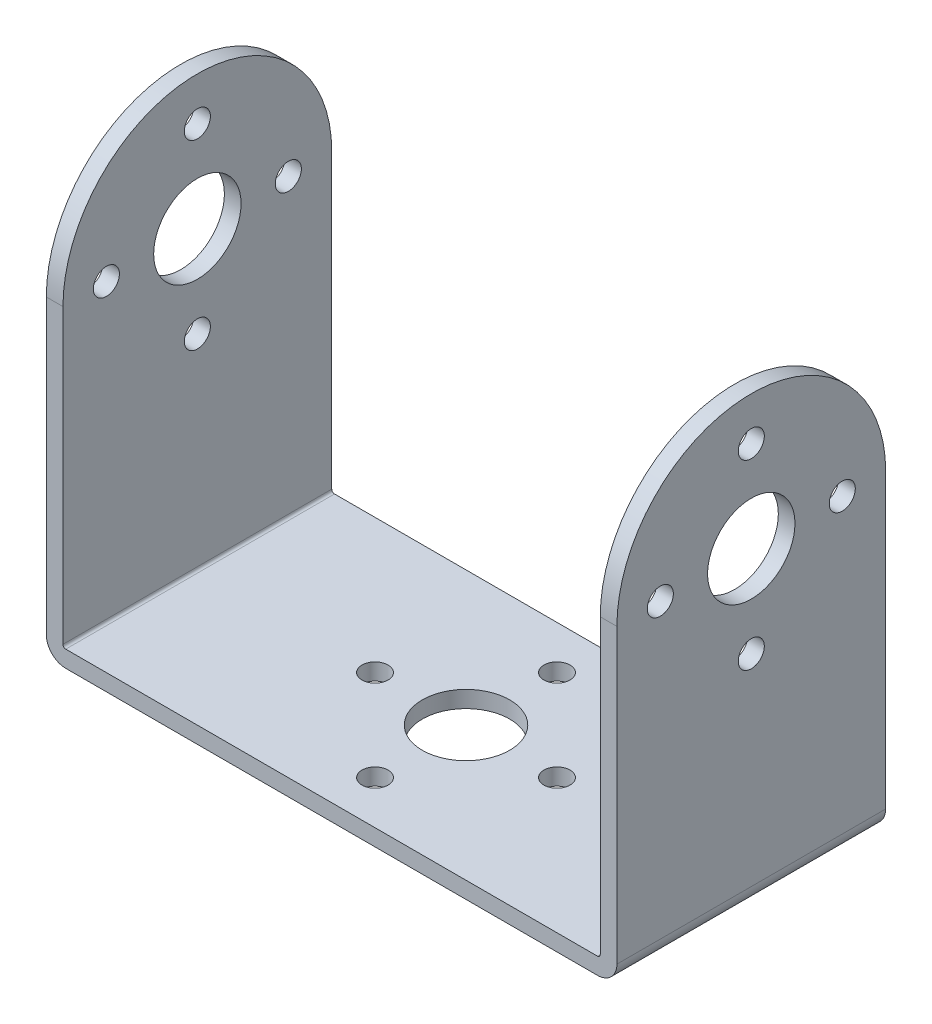
ISO-10303-21;
HEADER;
FILE_DESCRIPTION(('STEP AP214'),'2;1');
FILE_NAME('part.step','',(''),(''),'','','');
FILE_SCHEMA(('AUTOMOTIVE_DESIGN { 1 0 10303 214 1 1 1 1 }'));
ENDSEC;
DATA;
#1=APPLICATION_CONTEXT('core data for automotive mechanical design processes');
#2=APPLICATION_PROTOCOL_DEFINITION('international standard','automotive_design',2000,#1);
#3=PRODUCT_CONTEXT('',#1,'mechanical');
#4=PRODUCT('Part','Part','',(#3));
#5=PRODUCT_RELATED_PRODUCT_CATEGORY('part','',(#4));
#6=PRODUCT_DEFINITION_FORMATION('','',#4);
#7=PRODUCT_DEFINITION_CONTEXT('part definition',#1,'design');
#8=PRODUCT_DEFINITION('design','',#6,#7);
#9=PRODUCT_DEFINITION_SHAPE('','',#8);
#10=(LENGTH_UNIT() NAMED_UNIT(*) SI_UNIT(.MILLI.,.METRE.));
#11=(NAMED_UNIT(*) PLANE_ANGLE_UNIT() SI_UNIT($,.RADIAN.));
#12=(NAMED_UNIT(*) SI_UNIT($,.STERADIAN.) SOLID_ANGLE_UNIT());
#13=UNCERTAINTY_MEASURE_WITH_UNIT(LENGTH_MEASURE(1.E-05),#10,'distance_accuracy_value','');
#14=(GEOMETRIC_REPRESENTATION_CONTEXT(3) GLOBAL_UNCERTAINTY_ASSIGNED_CONTEXT((#13)) GLOBAL_UNIT_ASSIGNED_CONTEXT((#10,
#11,#12)) REPRESENTATION_CONTEXT('',''));
#15=CARTESIAN_POINT('',(0.,0.,0.));
#16=DIRECTION('',(0.,0.,1.));
#17=DIRECTION('',(1.,0.,0.));
#18=AXIS2_PLACEMENT_3D('',#15,#16,#17);
#19=CARTESIAN_POINT('',(-24.5999,40.8686,0.));
#20=DIRECTION('',(-1.,0.,0.));
#21=DIRECTION('',(0.,0.,1.));
#22=AXIS2_PLACEMENT_3D('',#19,#20,#21);
#23=PLANE('',#22);
#24=CARTESIAN_POINT('',(-24.5999,20.2438,0.));
#25=DIRECTION('',(-1.,0.,0.));
#26=DIRECTION('',(0.,0.,1.));
#27=AXIS2_PLACEMENT_3D('',#24,#25,#26);
#28=CIRCLE('',#27,1.1938);
#29=CARTESIAN_POINT('',(-24.5999,20.2438,1.1938));
#30=VERTEX_POINT('',#29);
#31=EDGE_CURVE('E463',#30,#30,#28,.T.);
#32=ORIENTED_EDGE('',*,*,#31,.T.);
#33=EDGE_LOOP('',(#32));
#34=FACE_BOUND('',#33,.T.);
#35=CARTESIAN_POINT('',(-24.5999,28.575,8.3312));
#36=DIRECTION('',(-1.,0.,0.));
#37=DIRECTION('',(0.,0.,1.));
#38=AXIS2_PLACEMENT_3D('',#35,#36,#37);
#39=CIRCLE('',#38,1.1938);
#40=CARTESIAN_POINT('',(-24.5999,28.575,9.525));
#41=VERTEX_POINT('',#40);
#42=EDGE_CURVE('E458',#41,#41,#39,.T.);
#43=ORIENTED_EDGE('',*,*,#42,.T.);
#44=EDGE_LOOP('',(#43));
#45=FACE_BOUND('',#44,.T.);
#46=CARTESIAN_POINT('',(-24.5999,36.9062,0.));
#47=DIRECTION('',(-1.,0.,0.));
#48=DIRECTION('',(0.,0.,1.));
#49=AXIS2_PLACEMENT_3D('',#46,#47,#48);
#50=CIRCLE('',#49,1.1938);
#51=CARTESIAN_POINT('',(-24.5999,36.9062,1.1938));
#52=VERTEX_POINT('',#51);
#53=EDGE_CURVE('E453',#52,#52,#50,.T.);
#54=ORIENTED_EDGE('',*,*,#53,.T.);
#55=EDGE_LOOP('',(#54));
#56=FACE_BOUND('',#55,.T.);
#57=CARTESIAN_POINT('',(-24.5999,28.575,-8.3312));
#58=DIRECTION('',(-1.,0.,0.));
#59=DIRECTION('',(0.,0.,1.));
#60=AXIS2_PLACEMENT_3D('',#57,#58,#59);
#61=CIRCLE('',#60,1.1938);
#62=CARTESIAN_POINT('',(-24.5999,28.575,-7.1374));
#63=VERTEX_POINT('',#62);
#64=EDGE_CURVE('E448',#63,#63,#61,.T.);
#65=ORIENTED_EDGE('',*,*,#64,.T.);
#66=EDGE_LOOP('',(#65));
#67=FACE_BOUND('',#66,.T.);
#68=DIRECTION('',(0.,-1.,0.));
#69=VECTOR('',#68,1.);
#70=CARTESIAN_POINT('',(-24.5999,40.8686,12.3063));
#71=LINE('',#70,#69);
#72=CARTESIAN_POINT('',(-24.5999,28.5623,12.3063));
#73=VERTEX_POINT('',#72);
#74=CARTESIAN_POINT('',(-24.5999,1.778,12.3063));
#75=VERTEX_POINT('',#74);
#76=EDGE_CURVE('E322',#73,#75,#71,.T.);
#77=ORIENTED_EDGE('',*,*,#76,.T.);
#78=DIRECTION('',(0.,0.,-1.));
#79=VECTOR('',#78,1.);
#80=CARTESIAN_POINT('',(-24.5999,1.778,0.));
#81=LINE('',#80,#79);
#82=CARTESIAN_POINT('',(-24.5999,1.778,-12.3063));
#83=VERTEX_POINT('',#82);
#84=EDGE_CURVE('E377',#75,#83,#81,.T.);
#85=ORIENTED_EDGE('',*,*,#84,.T.);
#86=DIRECTION('',(0.,-1.,0.));
#87=VECTOR('',#86,1.);
#88=CARTESIAN_POINT('',(-24.5999,40.8686,-12.3063));
#89=LINE('',#88,#87);
#90=CARTESIAN_POINT('',(-24.5999,28.5623,-12.3063));
#91=VERTEX_POINT('',#90);
#92=EDGE_CURVE('E335',#91,#83,#89,.T.);
#93=ORIENTED_EDGE('',*,*,#92,.F.);
#94=CARTESIAN_POINT('',(-24.5999,28.5623,0.));
#95=DIRECTION('',(-1.,0.,0.));
#96=DIRECTION('',(0.,0.,1.));
#97=AXIS2_PLACEMENT_3D('',#94,#95,#96);
#98=CIRCLE('',#97,12.3063);
#99=EDGE_CURVE('E314',#91,#73,#98,.F.);
#100=ORIENTED_EDGE('',*,*,#99,.T.);
#101=EDGE_LOOP('',(#77,#85,#93,#100));
#102=FACE_BOUND('',#101,.T.);
#103=CARTESIAN_POINT('',(-24.5999,28.575,0.));
#104=DIRECTION('',(-1.,0.,0.));
#105=DIRECTION('',(0.,0.,1.));
#106=AXIS2_PLACEMENT_3D('',#103,#104,#105);
#107=CIRCLE('',#106,4.0005);
#108=CARTESIAN_POINT('',(-24.5999,28.575,4.0005));
#109=VERTEX_POINT('',#108);
#110=EDGE_CURVE('E624',#109,#109,#107,.F.);
#111=ORIENTED_EDGE('',*,*,#110,.F.);
#112=EDGE_LOOP('',(#111));
#113=FACE_BOUND('',#112,.T.);
#114=ADVANCED_FACE('F213',(#34,#45,#56,#67,#102,#113),#23,.F.);
#115=CARTESIAN_POINT('',(-26.1239,40.8686,0.));
#116=DIRECTION('',(1.,0.,0.));
#117=DIRECTION('',(0.,0.,-1.));
#118=AXIS2_PLACEMENT_3D('',#115,#116,#117);
#119=PLANE('',#118);
#120=CARTESIAN_POINT('',(-26.1239,20.2438,0.));
#121=DIRECTION('',(1.,0.,0.));
#122=DIRECTION('',(0.,0.,-1.));
#123=AXIS2_PLACEMENT_3D('',#120,#121,#122);
#124=CIRCLE('',#123,1.1938);
#125=CARTESIAN_POINT('',(-26.1239,20.2438,-1.1938));
#126=VERTEX_POINT('',#125);
#127=EDGE_CURVE('E593',#126,#126,#124,.T.);
#128=ORIENTED_EDGE('',*,*,#127,.T.);
#129=EDGE_LOOP('',(#128));
#130=FACE_BOUND('',#129,.T.);
#131=CARTESIAN_POINT('',(-26.1239,28.575,8.3312));
#132=DIRECTION('',(1.,0.,0.));
#133=DIRECTION('',(0.,0.,-1.));
#134=AXIS2_PLACEMENT_3D('',#131,#132,#133);
#135=CIRCLE('',#134,1.1938);
#136=CARTESIAN_POINT('',(-26.1239,28.575,7.1374));
#137=VERTEX_POINT('',#136);
#138=EDGE_CURVE('E601',#137,#137,#135,.T.);
#139=ORIENTED_EDGE('',*,*,#138,.T.);
#140=EDGE_LOOP('',(#139));
#141=FACE_BOUND('',#140,.T.);
#142=CARTESIAN_POINT('',(-26.1239,36.9062,0.));
#143=DIRECTION('',(1.,0.,0.));
#144=DIRECTION('',(0.,0.,-1.));
#145=AXIS2_PLACEMENT_3D('',#142,#143,#144);
#146=CIRCLE('',#145,1.1938);
#147=CARTESIAN_POINT('',(-26.1239,36.9062,-1.1938));
#148=VERTEX_POINT('',#147);
#149=EDGE_CURVE('E608',#148,#148,#146,.T.);
#150=ORIENTED_EDGE('',*,*,#149,.T.);
#151=EDGE_LOOP('',(#150));
#152=FACE_BOUND('',#151,.T.);
#153=CARTESIAN_POINT('',(-26.1239,28.575,-8.3312));
#154=DIRECTION('',(1.,0.,0.));
#155=DIRECTION('',(0.,0.,-1.));
#156=AXIS2_PLACEMENT_3D('',#153,#154,#155);
#157=CIRCLE('',#156,1.1938);
#158=CARTESIAN_POINT('',(-26.1239,28.575,-9.525));
#159=VERTEX_POINT('',#158);
#160=EDGE_CURVE('E615',#159,#159,#157,.T.);
#161=ORIENTED_EDGE('',*,*,#160,.T.);
#162=EDGE_LOOP('',(#161));
#163=FACE_BOUND('',#162,.T.);
#164=DIRECTION('',(0.,-1.,0.));
#165=VECTOR('',#164,1.);
#166=CARTESIAN_POINT('',(-26.1239,40.8686,-12.3063));
#167=LINE('',#166,#165);
#168=CARTESIAN_POINT('',(-26.1239,28.5623,-12.3063));
#169=VERTEX_POINT('',#168);
#170=CARTESIAN_POINT('',(-26.1239,1.778,-12.3063));
#171=VERTEX_POINT('',#170);
#172=EDGE_CURVE('E331',#169,#171,#167,.T.);
#173=ORIENTED_EDGE('',*,*,#172,.T.);
#174=DIRECTION('',(0.,0.,1.));
#175=VECTOR('',#174,1.);
#176=CARTESIAN_POINT('',(-26.1239,1.778,0.));
#177=LINE('',#176,#175);
#178=CARTESIAN_POINT('',(-26.1239,1.778,12.3063));
#179=VERTEX_POINT('',#178);
#180=EDGE_CURVE('E330',#171,#179,#177,.T.);
#181=ORIENTED_EDGE('',*,*,#180,.T.);
#182=DIRECTION('',(0.,-1.,0.));
#183=VECTOR('',#182,1.);
#184=CARTESIAN_POINT('',(-26.1239,40.8686,12.3063));
#185=LINE('',#184,#183);
#186=CARTESIAN_POINT('',(-26.1239,28.5623,12.3063));
#187=VERTEX_POINT('',#186);
#188=EDGE_CURVE('E320',#187,#179,#185,.T.);
#189=ORIENTED_EDGE('',*,*,#188,.F.);
#190=CARTESIAN_POINT('',(-26.1239,28.5623,0.));
#191=DIRECTION('',(1.,0.,0.));
#192=DIRECTION('',(0.,0.,-1.));
#193=AXIS2_PLACEMENT_3D('',#190,#191,#192);
#194=CIRCLE('',#193,12.3063);
#195=EDGE_CURVE('E303',#187,#169,#194,.F.);
#196=ORIENTED_EDGE('',*,*,#195,.T.);
#197=EDGE_LOOP('',(#173,#181,#189,#196));
#198=FACE_BOUND('',#197,.T.);
#199=CARTESIAN_POINT('',(-26.1239,28.575,0.));
#200=DIRECTION('',(1.,0.,0.));
#201=DIRECTION('',(0.,0.,-1.));
#202=AXIS2_PLACEMENT_3D('',#199,#200,#201);
#203=CIRCLE('',#202,4.0005);
#204=CARTESIAN_POINT('',(-26.1239,28.575,-4.0005));
#205=VERTEX_POINT('',#204);
#206=EDGE_CURVE('E622',#205,#205,#203,.F.);
#207=ORIENTED_EDGE('',*,*,#206,.F.);
#208=EDGE_LOOP('',(#207));
#209=FACE_BOUND('',#208,.T.);
#210=ADVANCED_FACE('F327',(#130,#141,#152,#163,#198,#209),#119,.F.);
#211=CARTESIAN_POINT('',(24.5999,40.8686,0.));
#212=DIRECTION('',(-1.,0.,0.));
#213=DIRECTION('',(0.,0.,1.));
#214=AXIS2_PLACEMENT_3D('',#211,#212,#213);
#215=PLANE('',#214);
#216=CARTESIAN_POINT('',(24.5999,20.2438,0.));
#217=DIRECTION('',(-1.,0.,0.));
#218=DIRECTION('',(0.,0.,1.));
#219=AXIS2_PLACEMENT_3D('',#216,#217,#218);
#220=CIRCLE('',#219,1.1938);
#221=CARTESIAN_POINT('',(24.5999,20.2438,1.1938));
#222=VERTEX_POINT('',#221);
#223=EDGE_CURVE('E466',#222,#222,#220,.T.);
#224=ORIENTED_EDGE('',*,*,#223,.F.);
#225=EDGE_LOOP('',(#224));
#226=FACE_BOUND('',#225,.T.);
#227=CARTESIAN_POINT('',(24.5999,28.575,8.3312));
#228=DIRECTION('',(-1.,0.,0.));
#229=DIRECTION('',(0.,0.,1.));
#230=AXIS2_PLACEMENT_3D('',#227,#228,#229);
#231=CIRCLE('',#230,1.1938);
#232=CARTESIAN_POINT('',(24.5999,28.575,9.525));
#233=VERTEX_POINT('',#232);
#234=EDGE_CURVE('E462',#233,#233,#231,.T.);
#235=ORIENTED_EDGE('',*,*,#234,.F.);
#236=EDGE_LOOP('',(#235));
#237=FACE_BOUND('',#236,.T.);
#238=CARTESIAN_POINT('',(24.5999,36.9062,0.));
#239=DIRECTION('',(-1.,0.,0.));
#240=DIRECTION('',(0.,0.,1.));
#241=AXIS2_PLACEMENT_3D('',#238,#239,#240);
#242=CIRCLE('',#241,1.1938);
#243=CARTESIAN_POINT('',(24.5999,36.9062,1.1938));
#244=VERTEX_POINT('',#243);
#245=EDGE_CURVE('E457',#244,#244,#242,.T.);
#246=ORIENTED_EDGE('',*,*,#245,.F.);
#247=EDGE_LOOP('',(#246));
#248=FACE_BOUND('',#247,.T.);
#249=CARTESIAN_POINT('',(24.5999,28.575,-8.3312));
#250=DIRECTION('',(-1.,0.,0.));
#251=DIRECTION('',(0.,0.,1.));
#252=AXIS2_PLACEMENT_3D('',#249,#250,#251);
#253=CIRCLE('',#252,1.1938);
#254=CARTESIAN_POINT('',(24.5999,28.575,-7.1374));
#255=VERTEX_POINT('',#254);
#256=EDGE_CURVE('E452',#255,#255,#253,.T.);
#257=ORIENTED_EDGE('',*,*,#256,.F.);
#258=EDGE_LOOP('',(#257));
#259=FACE_BOUND('',#258,.T.);
#260=DIRECTION('',(0.,-1.,0.));
#261=VECTOR('',#260,1.);
#262=CARTESIAN_POINT('',(24.5999,40.8686,-12.3063));
#263=LINE('',#262,#261);
#264=CARTESIAN_POINT('',(24.5999,28.5623,-12.3063));
#265=VERTEX_POINT('',#264);
#266=CARTESIAN_POINT('',(24.5999,1.778,-12.3063));
#267=VERTEX_POINT('',#266);
#268=EDGE_CURVE('E436',#265,#267,#263,.T.);
#269=ORIENTED_EDGE('',*,*,#268,.T.);
#270=DIRECTION('',(0.,0.,-1.));
#271=VECTOR('',#270,1.);
#272=CARTESIAN_POINT('',(24.5999,1.778,12.3063));
#273=LINE('',#272,#271);
#274=CARTESIAN_POINT('',(24.5999,1.778,12.3063));
#275=VERTEX_POINT('',#274);
#276=EDGE_CURVE('E392',#267,#275,#273,.F.);
#277=ORIENTED_EDGE('',*,*,#276,.T.);
#278=DIRECTION('',(0.,-1.,0.));
#279=VECTOR('',#278,1.);
#280=CARTESIAN_POINT('',(24.5999,40.8686,12.3063));
#281=LINE('',#280,#279);
#282=CARTESIAN_POINT('',(24.5999,28.5623,12.3063));
#283=VERTEX_POINT('',#282);
#284=EDGE_CURVE('E431',#283,#275,#281,.T.);
#285=ORIENTED_EDGE('',*,*,#284,.F.);
#286=CARTESIAN_POINT('',(24.5999,28.5623,0.));
#287=DIRECTION('',(-1.,0.,0.));
#288=DIRECTION('',(0.,0.,1.));
#289=AXIS2_PLACEMENT_3D('',#286,#287,#288);
#290=CIRCLE('',#289,12.3063);
#291=EDGE_CURVE('E315',#265,#283,#290,.F.);
#292=ORIENTED_EDGE('',*,*,#291,.F.);
#293=EDGE_LOOP('',(#269,#277,#285,#292));
#294=FACE_BOUND('',#293,.T.);
#295=CARTESIAN_POINT('',(24.5999,28.575,0.));
#296=DIRECTION('',(-1.,0.,0.));
#297=DIRECTION('',(0.,0.,1.));
#298=AXIS2_PLACEMENT_3D('',#295,#296,#297);
#299=CIRCLE('',#298,4.0005);
#300=CARTESIAN_POINT('',(24.5999,28.575,4.0005));
#301=VERTEX_POINT('',#300);
#302=EDGE_CURVE('E447',#301,#301,#299,.F.);
#303=ORIENTED_EDGE('',*,*,#302,.T.);
#304=EDGE_LOOP('',(#303));
#305=FACE_BOUND('',#304,.T.);
#306=ADVANCED_FACE('F488',(#226,#237,#248,#259,#294,#305),#215,.T.);
#307=CARTESIAN_POINT('',(26.1239,40.8686,0.));
#308=DIRECTION('',(1.,0.,0.));
#309=DIRECTION('',(0.,0.,-1.));
#310=AXIS2_PLACEMENT_3D('',#307,#308,#309);
#311=PLANE('',#310);
#312=CARTESIAN_POINT('',(26.1239,20.2438,0.));
#313=DIRECTION('',(1.,0.,0.));
#314=DIRECTION('',(0.,0.,-1.));
#315=AXIS2_PLACEMENT_3D('',#312,#313,#314);
#316=CIRCLE('',#315,1.1938);
#317=CARTESIAN_POINT('',(26.1239,20.2438,-1.1938));
#318=VERTEX_POINT('',#317);
#319=EDGE_CURVE('E464',#318,#318,#316,.T.);
#320=ORIENTED_EDGE('',*,*,#319,.F.);
#321=EDGE_LOOP('',(#320));
#322=FACE_BOUND('',#321,.T.);
#323=CARTESIAN_POINT('',(26.1239,28.575,8.3312));
#324=DIRECTION('',(1.,0.,0.));
#325=DIRECTION('',(0.,0.,-1.));
#326=AXIS2_PLACEMENT_3D('',#323,#324,#325);
#327=CIRCLE('',#326,1.1938);
#328=CARTESIAN_POINT('',(26.1239,28.575,7.1374));
#329=VERTEX_POINT('',#328);
#330=EDGE_CURVE('E459',#329,#329,#327,.T.);
#331=ORIENTED_EDGE('',*,*,#330,.F.);
#332=EDGE_LOOP('',(#331));
#333=FACE_BOUND('',#332,.T.);
#334=CARTESIAN_POINT('',(26.1239,36.9062,0.));
#335=DIRECTION('',(1.,0.,0.));
#336=DIRECTION('',(0.,0.,-1.));
#337=AXIS2_PLACEMENT_3D('',#334,#335,#336);
#338=CIRCLE('',#337,1.1938);
#339=CARTESIAN_POINT('',(26.1239,36.9062,-1.1938));
#340=VERTEX_POINT('',#339);
#341=EDGE_CURVE('E454',#340,#340,#338,.T.);
#342=ORIENTED_EDGE('',*,*,#341,.F.);
#343=EDGE_LOOP('',(#342));
#344=FACE_BOUND('',#343,.T.);
#345=CARTESIAN_POINT('',(26.1239,28.575,-8.3312));
#346=DIRECTION('',(1.,0.,0.));
#347=DIRECTION('',(0.,0.,-1.));
#348=AXIS2_PLACEMENT_3D('',#345,#346,#347);
#349=CIRCLE('',#348,1.1938);
#350=CARTESIAN_POINT('',(26.1239,28.575,-9.525));
#351=VERTEX_POINT('',#350);
#352=EDGE_CURVE('E449',#351,#351,#349,.T.);
#353=ORIENTED_EDGE('',*,*,#352,.F.);
#354=EDGE_LOOP('',(#353));
#355=FACE_BOUND('',#354,.T.);
#356=DIRECTION('',(0.,-1.,0.));
#357=VECTOR('',#356,1.);
#358=CARTESIAN_POINT('',(26.1239,40.8686,12.3063));
#359=LINE('',#358,#357);
#360=CARTESIAN_POINT('',(26.1239,28.5623,12.3063));
#361=VERTEX_POINT('',#360);
#362=CARTESIAN_POINT('',(26.1239,1.778,12.3063));
#363=VERTEX_POINT('',#362);
#364=EDGE_CURVE('E426',#361,#363,#359,.T.);
#365=ORIENTED_EDGE('',*,*,#364,.T.);
#366=DIRECTION('',(0.,0.,1.));
#367=VECTOR('',#366,1.);
#368=CARTESIAN_POINT('',(26.1239,1.778,-12.3063));
#369=LINE('',#368,#367);
#370=CARTESIAN_POINT('',(26.1239,1.778,-12.3063));
#371=VERTEX_POINT('',#370);
#372=EDGE_CURVE('E12',#363,#371,#369,.F.);
#373=ORIENTED_EDGE('',*,*,#372,.T.);
#374=DIRECTION('',(0.,-1.,0.));
#375=VECTOR('',#374,1.);
#376=CARTESIAN_POINT('',(26.1239,40.8686,-12.3063));
#377=LINE('',#376,#375);
#378=CARTESIAN_POINT('',(26.1239,28.5623,-12.3063));
#379=VERTEX_POINT('',#378);
#380=EDGE_CURVE('E432',#379,#371,#377,.T.);
#381=ORIENTED_EDGE('',*,*,#380,.F.);
#382=CARTESIAN_POINT('',(26.1239,28.5623,0.));
#383=DIRECTION('',(1.,0.,0.));
#384=DIRECTION('',(0.,0.,-1.));
#385=AXIS2_PLACEMENT_3D('',#382,#383,#384);
#386=CIRCLE('',#385,12.3063);
#387=EDGE_CURVE('E429',#361,#379,#386,.F.);
#388=ORIENTED_EDGE('',*,*,#387,.F.);
#389=EDGE_LOOP('',(#365,#373,#381,#388));
#390=FACE_BOUND('',#389,.T.);
#391=CARTESIAN_POINT('',(26.1239,28.575,0.));
#392=DIRECTION('',(1.,0.,0.));
#393=DIRECTION('',(0.,0.,-1.));
#394=AXIS2_PLACEMENT_3D('',#391,#392,#393);
#395=CIRCLE('',#394,4.0005);
#396=CARTESIAN_POINT('',(26.1239,28.575,-4.0005));
#397=VERTEX_POINT('',#396);
#398=EDGE_CURVE('E444',#397,#397,#395,.F.);
#399=ORIENTED_EDGE('',*,*,#398,.T.);
#400=EDGE_LOOP('',(#399));
#401=FACE_BOUND('',#400,.T.);
#402=ADVANCED_FACE('F427',(#322,#333,#344,#355,#390,#401),#311,.T.);
#403=CARTESIAN_POINT('',(-45.0640846074071,1.524,12.3063));
#404=DIRECTION('',(0.,0.,1.));
#405=DIRECTION('',(1.,0.,0.));
#406=AXIS2_PLACEMENT_3D('',#403,#404,#405);
#407=PLANE('',#406);
#408=ORIENTED_EDGE('',*,*,#188,.T.);
#409=CARTESIAN_POINT('',(-24.3459,1.778,12.3063));
#410=DIRECTION('',(0.,0.,1.));
#411=DIRECTION('',(1.,0.,0.));
#412=AXIS2_PLACEMENT_3D('',#409,#410,#411);
#413=CIRCLE('',#412,1.778);
#414=CARTESIAN_POINT('',(-24.3459,0.,12.3063));
#415=VERTEX_POINT('',#414);
#416=EDGE_CURVE('E405',#179,#415,#413,.T.);
#417=ORIENTED_EDGE('',*,*,#416,.T.);
#418=DIRECTION('',(-1.,0.,0.));
#419=VECTOR('',#418,1.);
#420=CARTESIAN_POINT('',(-45.0640846074071,0.,12.3063));
#421=LINE('',#420,#419);
#422=CARTESIAN_POINT('',(24.3459,0.,12.3063));
#423=VERTEX_POINT('',#422);
#424=EDGE_CURVE('E343',#423,#415,#421,.T.);
#425=ORIENTED_EDGE('',*,*,#424,.F.);
#426=CARTESIAN_POINT('',(24.3459,1.778,12.3063));
#427=DIRECTION('',(0.,0.,1.));
#428=DIRECTION('',(1.,0.,0.));
#429=AXIS2_PLACEMENT_3D('',#426,#427,#428);
#430=CIRCLE('',#429,1.778);
#431=EDGE_CURVE('E403',#423,#363,#430,.T.);
#432=ORIENTED_EDGE('',*,*,#431,.T.);
#433=ORIENTED_EDGE('',*,*,#364,.F.);
#434=DIRECTION('',(1.,0.,0.));
#435=VECTOR('',#434,1.);
#436=CARTESIAN_POINT('',(-40.8686,28.5623,12.3063));
#437=LINE('',#436,#435);
#438=EDGE_CURVE('E324',#283,#361,#437,.T.);
#439=ORIENTED_EDGE('',*,*,#438,.F.);
#440=ORIENTED_EDGE('',*,*,#284,.T.);
#441=CARTESIAN_POINT('',(24.3459,1.778,12.3063));
#442=DIRECTION('',(0.,0.,1.));
#443=DIRECTION('',(1.,0.,0.));
#444=AXIS2_PLACEMENT_3D('',#441,#442,#443);
#445=CIRCLE('',#444,0.254);
#446=CARTESIAN_POINT('',(24.3459,1.524,12.3063));
#447=VERTEX_POINT('',#446);
#448=EDGE_CURVE('E400',#275,#447,#445,.F.);
#449=ORIENTED_EDGE('',*,*,#448,.T.);
#450=DIRECTION('',(-1.,0.,0.));
#451=VECTOR('',#450,1.);
#452=CARTESIAN_POINT('',(-45.0640846074071,1.524,12.3063));
#453=LINE('',#452,#451);
#454=CARTESIAN_POINT('',(-24.3459,1.524,12.3063));
#455=VERTEX_POINT('',#454);
#456=EDGE_CURVE('E363',#447,#455,#453,.T.);
#457=ORIENTED_EDGE('',*,*,#456,.T.);
#458=CARTESIAN_POINT('',(-24.3459,1.778,12.3063));
#459=DIRECTION('',(0.,0.,1.));
#460=DIRECTION('',(1.,0.,0.));
#461=AXIS2_PLACEMENT_3D('',#458,#459,#460);
#462=CIRCLE('',#461,0.254);
#463=EDGE_CURVE('E396',#455,#75,#462,.F.);
#464=ORIENTED_EDGE('',*,*,#463,.T.);
#465=ORIENTED_EDGE('',*,*,#76,.F.);
#466=EDGE_CURVE('E306',#187,#73,#437,.T.);
#467=ORIENTED_EDGE('',*,*,#466,.F.);
#468=EDGE_LOOP('',(#408,#417,#425,#432,#433,#439,#440,#449,#457,#464,#465,#467));
#469=FACE_BOUND('',#468,.T.);
#470=ADVANCED_FACE('F319',(#469),#407,.T.);
#471=CARTESIAN_POINT('',(-45.0640846074071,1.524,-12.3063));
#472=DIRECTION('',(0.,0.,-1.));
#473=DIRECTION('',(-1.,0.,0.));
#474=AXIS2_PLACEMENT_3D('',#471,#472,#473);
#475=PLANE('',#474);
#476=DIRECTION('',(1.,0.,0.));
#477=VECTOR('',#476,1.);
#478=CARTESIAN_POINT('',(-45.0640846074071,0.,-12.3063));
#479=LINE('',#478,#477);
#480=CARTESIAN_POINT('',(-24.3459,0.,-12.3063));
#481=VERTEX_POINT('',#480);
#482=CARTESIAN_POINT('',(24.3459,0.,-12.3063));
#483=VERTEX_POINT('',#482);
#484=EDGE_CURVE('E346',#481,#483,#479,.T.);
#485=ORIENTED_EDGE('',*,*,#484,.F.);
#486=CARTESIAN_POINT('',(-24.3459,1.778,-12.3063));
#487=DIRECTION('',(0.,0.,-1.));
#488=DIRECTION('',(-1.,0.,0.));
#489=AXIS2_PLACEMENT_3D('',#486,#487,#488);
#490=CIRCLE('',#489,1.778);
#491=EDGE_CURVE('E221',#481,#171,#490,.T.);
#492=ORIENTED_EDGE('',*,*,#491,.T.);
#493=ORIENTED_EDGE('',*,*,#172,.F.);
#494=DIRECTION('',(1.,0.,0.));
#495=VECTOR('',#494,1.);
#496=CARTESIAN_POINT('',(-40.8686,28.5623,-12.3063));
#497=LINE('',#496,#495);
#498=EDGE_CURVE('E309',#169,#91,#497,.T.);
#499=ORIENTED_EDGE('',*,*,#498,.T.);
#500=ORIENTED_EDGE('',*,*,#92,.T.);
#501=CARTESIAN_POINT('',(-24.3459,1.778,-12.3063));
#502=DIRECTION('',(0.,0.,-1.));
#503=DIRECTION('',(-1.,0.,0.));
#504=AXIS2_PLACEMENT_3D('',#501,#502,#503);
#505=CIRCLE('',#504,0.254);
#506=CARTESIAN_POINT('',(-24.3459,1.524,-12.3063));
#507=VERTEX_POINT('',#506);
#508=EDGE_CURVE('E394',#83,#507,#505,.F.);
#509=ORIENTED_EDGE('',*,*,#508,.T.);
#510=DIRECTION('',(1.,0.,0.));
#511=VECTOR('',#510,1.);
#512=CARTESIAN_POINT('',(-45.0640846074071,1.524,-12.3063));
#513=LINE('',#512,#511);
#514=CARTESIAN_POINT('',(24.3459,1.524,-12.3063));
#515=VERTEX_POINT('',#514);
#516=EDGE_CURVE('E368',#507,#515,#513,.T.);
#517=ORIENTED_EDGE('',*,*,#516,.T.);
#518=CARTESIAN_POINT('',(24.3459,1.778,-12.3063));
#519=DIRECTION('',(0.,0.,-1.));
#520=DIRECTION('',(-1.,0.,0.));
#521=AXIS2_PLACEMENT_3D('',#518,#519,#520);
#522=CIRCLE('',#521,0.254);
#523=EDGE_CURVE('E398',#515,#267,#522,.F.);
#524=ORIENTED_EDGE('',*,*,#523,.T.);
#525=ORIENTED_EDGE('',*,*,#268,.F.);
#526=EDGE_CURVE('E323',#265,#379,#497,.T.);
#527=ORIENTED_EDGE('',*,*,#526,.T.);
#528=ORIENTED_EDGE('',*,*,#380,.T.);
#529=CARTESIAN_POINT('',(24.3459,1.778,-12.3063));
#530=DIRECTION('',(0.,0.,-1.));
#531=DIRECTION('',(-1.,0.,0.));
#532=AXIS2_PLACEMENT_3D('',#529,#530,#531);
#533=CIRCLE('',#532,1.778);
#534=EDGE_CURVE('E233',#371,#483,#533,.T.);
#535=ORIENTED_EDGE('',*,*,#534,.T.);
#536=EDGE_LOOP('',(#485,#492,#493,#499,#500,#509,#517,#524,#525,#527,#528,#535));
#537=FACE_BOUND('',#536,.T.);
#538=ADVANCED_FACE('F413',(#537),#475,.T.);
#539=CARTESIAN_POINT('',(0.,1.524,0.));
#540=DIRECTION('',(0.,-1.,0.));
#541=DIRECTION('',(0.,0.,-1.));
#542=AXIS2_PLACEMENT_3D('',#539,#540,#541);
#543=CYLINDRICAL_SURFACE('',#542,4.0005);
#544=CARTESIAN_POINT('',(0.,1.524,0.));
#545=DIRECTION('',(0.,1.,0.));
#546=DIRECTION('',(0.,0.,1.));
#547=AXIS2_PLACEMENT_3D('',#544,#545,#546);
#548=CIRCLE('',#547,4.0005);
#549=CARTESIAN_POINT('',(0.,1.524,4.0005));
#550=VERTEX_POINT('',#549);
#551=EDGE_CURVE('E371',#550,#550,#548,.T.);
#552=ORIENTED_EDGE('',*,*,#551,.T.);
#553=EDGE_LOOP('',(#552));
#554=FACE_BOUND('',#553,.T.);
#555=CARTESIAN_POINT('',(0.,0.,0.));
#556=DIRECTION('',(0.,1.,0.));
#557=DIRECTION('',(0.,0.,1.));
#558=AXIS2_PLACEMENT_3D('',#555,#556,#557);
#559=CIRCLE('',#558,4.0005);
#560=CARTESIAN_POINT('',(0.,0.,4.0005));
#561=VERTEX_POINT('',#560);
#562=EDGE_CURVE('E354',#561,#561,#559,.T.);
#563=ORIENTED_EDGE('',*,*,#562,.F.);
#564=EDGE_LOOP('',(#563));
#565=FACE_BOUND('',#564,.T.);
#566=ADVANCED_FACE('F537',(#554,#565),#543,.F.);
#567=CARTESIAN_POINT('',(-8.3312,1.524,0.));
#568=DIRECTION('',(0.,-1.,0.));
#569=DIRECTION('',(0.,0.,-1.));
#570=AXIS2_PLACEMENT_3D('',#567,#568,#569);
#571=CYLINDRICAL_SURFACE('',#570,1.1938);
#572=CARTESIAN_POINT('',(-8.3312,1.524,0.));
#573=DIRECTION('',(0.,1.,0.));
#574=DIRECTION('',(0.,0.,1.));
#575=AXIS2_PLACEMENT_3D('',#572,#573,#574);
#576=CIRCLE('',#575,1.1938);
#577=CARTESIAN_POINT('',(-8.3312,1.524,1.1938));
#578=VERTEX_POINT('',#577);
#579=EDGE_CURVE('E367',#578,#578,#576,.T.);
#580=ORIENTED_EDGE('',*,*,#579,.T.);
#581=EDGE_LOOP('',(#580));
#582=FACE_BOUND('',#581,.T.);
#583=CARTESIAN_POINT('',(-8.3312,0.,0.));
#584=DIRECTION('',(0.,1.,0.));
#585=DIRECTION('',(0.,0.,1.));
#586=AXIS2_PLACEMENT_3D('',#583,#584,#585);
#587=CIRCLE('',#586,1.1938);
#588=CARTESIAN_POINT('',(-8.3312,0.,1.1938));
#589=VERTEX_POINT('',#588);
#590=EDGE_CURVE('E351',#589,#589,#587,.T.);
#591=ORIENTED_EDGE('',*,*,#590,.F.);
#592=EDGE_LOOP('',(#591));
#593=FACE_BOUND('',#592,.T.);
#594=ADVANCED_FACE('F540',(#582,#593),#571,.F.);
#595=CARTESIAN_POINT('',(0.,1.524,-8.3312));
#596=DIRECTION('',(0.,-1.,0.));
#597=DIRECTION('',(0.,0.,-1.));
#598=AXIS2_PLACEMENT_3D('',#595,#596,#597);
#599=CYLINDRICAL_SURFACE('',#598,1.1938);
#600=CARTESIAN_POINT('',(0.,1.524,-8.3312));
#601=DIRECTION('',(0.,1.,0.));
#602=DIRECTION('',(0.,0.,1.));
#603=AXIS2_PLACEMENT_3D('',#600,#601,#602);
#604=CIRCLE('',#603,1.1938);
#605=CARTESIAN_POINT('',(0.,1.524,-7.1374));
#606=VERTEX_POINT('',#605);
#607=EDGE_CURVE('E364',#606,#606,#604,.T.);
#608=ORIENTED_EDGE('',*,*,#607,.T.);
#609=EDGE_LOOP('',(#608));
#610=FACE_BOUND('',#609,.T.);
#611=CARTESIAN_POINT('',(0.,0.,-8.3312));
#612=DIRECTION('',(0.,1.,0.));
#613=DIRECTION('',(0.,0.,1.));
#614=AXIS2_PLACEMENT_3D('',#611,#612,#613);
#615=CIRCLE('',#614,1.1938);
#616=CARTESIAN_POINT('',(0.,0.,-7.1374));
#617=VERTEX_POINT('',#616);
#618=EDGE_CURVE('E348',#617,#617,#615,.T.);
#619=ORIENTED_EDGE('',*,*,#618,.F.);
#620=EDGE_LOOP('',(#619));
#621=FACE_BOUND('',#620,.T.);
#622=ADVANCED_FACE('F544',(#610,#621),#599,.F.);
#623=CARTESIAN_POINT('',(0.,1.524,8.3312));
#624=DIRECTION('',(0.,-1.,0.));
#625=DIRECTION('',(0.,0.,-1.));
#626=AXIS2_PLACEMENT_3D('',#623,#624,#625);
#627=CYLINDRICAL_SURFACE('',#626,1.1938);
#628=CARTESIAN_POINT('',(0.,1.524,8.3312));
#629=DIRECTION('',(0.,1.,0.));
#630=DIRECTION('',(0.,0.,1.));
#631=AXIS2_PLACEMENT_3D('',#628,#629,#630);
#632=CIRCLE('',#631,1.1938);
#633=CARTESIAN_POINT('',(0.,1.524,9.525));
#634=VERTEX_POINT('',#633);
#635=EDGE_CURVE('E360',#634,#634,#632,.T.);
#636=ORIENTED_EDGE('',*,*,#635,.T.);
#637=EDGE_LOOP('',(#636));
#638=FACE_BOUND('',#637,.T.);
#639=CARTESIAN_POINT('',(0.,0.,8.3312));
#640=DIRECTION('',(0.,1.,0.));
#641=DIRECTION('',(0.,0.,1.));
#642=AXIS2_PLACEMENT_3D('',#639,#640,#641);
#643=CIRCLE('',#642,1.1938);
#644=CARTESIAN_POINT('',(0.,0.,9.525));
#645=VERTEX_POINT('',#644);
#646=EDGE_CURVE('E333',#645,#645,#643,.T.);
#647=ORIENTED_EDGE('',*,*,#646,.F.);
#648=EDGE_LOOP('',(#647));
#649=FACE_BOUND('',#648,.T.);
#650=ADVANCED_FACE('F215',(#638,#649),#627,.F.);
#651=CARTESIAN_POINT('',(8.3312,1.524,0.));
#652=DIRECTION('',(0.,-1.,0.));
#653=DIRECTION('',(0.,0.,-1.));
#654=AXIS2_PLACEMENT_3D('',#651,#652,#653);
#655=CYLINDRICAL_SURFACE('',#654,1.1938);
#656=CARTESIAN_POINT('',(8.3312,1.524,0.));
#657=DIRECTION('',(0.,1.,0.));
#658=DIRECTION('',(0.,0.,1.));
#659=AXIS2_PLACEMENT_3D('',#656,#657,#658);
#660=CIRCLE('',#659,1.1938);
#661=CARTESIAN_POINT('',(8.3312,1.524,1.1938));
#662=VERTEX_POINT('',#661);
#663=EDGE_CURVE('E374',#662,#662,#660,.F.);
#664=ORIENTED_EDGE('',*,*,#663,.F.);
#665=EDGE_LOOP('',(#664));
#666=FACE_BOUND('',#665,.T.);
#667=CARTESIAN_POINT('',(8.3312,0.,0.));
#668=DIRECTION('',(0.,1.,0.));
#669=DIRECTION('',(0.,0.,1.));
#670=AXIS2_PLACEMENT_3D('',#667,#668,#669);
#671=CIRCLE('',#670,1.1938);
#672=CARTESIAN_POINT('',(8.3312,0.,1.1938));
#673=VERTEX_POINT('',#672);
#674=EDGE_CURVE('E357',#673,#673,#671,.F.);
#675=ORIENTED_EDGE('',*,*,#674,.T.);
#676=EDGE_LOOP('',(#675));
#677=FACE_BOUND('',#676,.T.);
#678=ADVANCED_FACE('F532',(#666,#677),#655,.F.);
#679=CARTESIAN_POINT('',(-45.0640846074071,1.524,0.));
#680=DIRECTION('',(0.,1.,0.));
#681=DIRECTION('',(0.,0.,1.));
#682=AXIS2_PLACEMENT_3D('',#679,#680,#681);
#683=PLANE('',#682);
#684=ORIENTED_EDGE('',*,*,#635,.F.);
#685=EDGE_LOOP('',(#684));
#686=FACE_BOUND('',#685,.T.);
#687=ORIENTED_EDGE('',*,*,#516,.F.);
#688=DIRECTION('',(0.,0.,-1.));
#689=VECTOR('',#688,1.);
#690=CARTESIAN_POINT('',(-24.3459,1.524,0.));
#691=LINE('',#690,#689);
#692=EDGE_CURVE('E390',#507,#455,#691,.F.);
#693=ORIENTED_EDGE('',*,*,#692,.T.);
#694=ORIENTED_EDGE('',*,*,#456,.F.);
#695=DIRECTION('',(0.,0.,-1.));
#696=VECTOR('',#695,1.);
#697=CARTESIAN_POINT('',(24.3459,1.524,-12.3063));
#698=LINE('',#697,#696);
#699=EDGE_CURVE('E387',#447,#515,#698,.T.);
#700=ORIENTED_EDGE('',*,*,#699,.T.);
#701=EDGE_LOOP('',(#687,#693,#694,#700));
#702=FACE_BOUND('',#701,.T.);
#703=ORIENTED_EDGE('',*,*,#607,.F.);
#704=EDGE_LOOP('',(#703));
#705=FACE_BOUND('',#704,.T.);
#706=ORIENTED_EDGE('',*,*,#579,.F.);
#707=EDGE_LOOP('',(#706));
#708=FACE_BOUND('',#707,.T.);
#709=ORIENTED_EDGE('',*,*,#551,.F.);
#710=EDGE_LOOP('',(#709));
#711=FACE_BOUND('',#710,.T.);
#712=ORIENTED_EDGE('',*,*,#663,.T.);
#713=EDGE_LOOP('',(#712));
#714=FACE_BOUND('',#713,.T.);
#715=ADVANCED_FACE('F498',(#686,#702,#705,#708,#711,#714),#683,.T.);
#716=CARTESIAN_POINT('',(-45.0640846074071,0.,0.));
#717=DIRECTION('',(0.,1.,0.));
#718=DIRECTION('',(0.,0.,1.));
#719=AXIS2_PLACEMENT_3D('',#716,#717,#718);
#720=PLANE('',#719);
#721=ORIENTED_EDGE('',*,*,#646,.T.);
#722=EDGE_LOOP('',(#721));
#723=FACE_BOUND('',#722,.T.);
#724=ORIENTED_EDGE('',*,*,#424,.T.);
#725=DIRECTION('',(0.,0.,1.));
#726=VECTOR('',#725,1.);
#727=CARTESIAN_POINT('',(-24.3459,0.,0.));
#728=LINE('',#727,#726);
#729=EDGE_CURVE('E410',#415,#481,#728,.F.);
#730=ORIENTED_EDGE('',*,*,#729,.T.);
#731=ORIENTED_EDGE('',*,*,#484,.T.);
#732=DIRECTION('',(0.,0.,1.));
#733=VECTOR('',#732,1.);
#734=CARTESIAN_POINT('',(24.3459,0.,12.3063));
#735=LINE('',#734,#733);
#736=EDGE_CURVE('E407',#483,#423,#735,.T.);
#737=ORIENTED_EDGE('',*,*,#736,.T.);
#738=EDGE_LOOP('',(#724,#730,#731,#737));
#739=FACE_BOUND('',#738,.T.);
#740=ORIENTED_EDGE('',*,*,#618,.T.);
#741=EDGE_LOOP('',(#740));
#742=FACE_BOUND('',#741,.T.);
#743=ORIENTED_EDGE('',*,*,#590,.T.);
#744=EDGE_LOOP('',(#743));
#745=FACE_BOUND('',#744,.T.);
#746=ORIENTED_EDGE('',*,*,#562,.T.);
#747=EDGE_LOOP('',(#746));
#748=FACE_BOUND('',#747,.T.);
#749=ORIENTED_EDGE('',*,*,#674,.F.);
#750=EDGE_LOOP('',(#749));
#751=FACE_BOUND('',#750,.T.);
#752=ADVANCED_FACE('F419',(#723,#739,#742,#745,#748,#751),#720,.F.);
#753=CARTESIAN_POINT('',(-40.8686,28.5623,0.));
#754=DIRECTION('',(1.,0.,0.));
#755=DIRECTION('',(0.,0.,-1.));
#756=AXIS2_PLACEMENT_3D('',#753,#754,#755);
#757=CYLINDRICAL_SURFACE('',#756,12.3063);
#758=ORIENTED_EDGE('',*,*,#291,.T.);
#759=ORIENTED_EDGE('',*,*,#438,.T.);
#760=ORIENTED_EDGE('',*,*,#387,.T.);
#761=ORIENTED_EDGE('',*,*,#526,.F.);
#762=EDGE_LOOP('',(#758,#759,#760,#761));
#763=FACE_BOUND('',#762,.T.);
#764=ADVANCED_FACE('F528',(#763),#757,.T.);
#765=ORIENTED_EDGE('',*,*,#498,.F.);
#766=ORIENTED_EDGE('',*,*,#195,.F.);
#767=ORIENTED_EDGE('',*,*,#466,.T.);
#768=ORIENTED_EDGE('',*,*,#99,.F.);
#769=EDGE_LOOP('',(#765,#766,#767,#768));
#770=FACE_BOUND('',#769,.T.);
#771=ADVANCED_FACE('F305',(#770),#757,.T.);
#772=CARTESIAN_POINT('',(-40.8686,28.575,0.));
#773=DIRECTION('',(1.,0.,0.));
#774=DIRECTION('',(0.,0.,-1.));
#775=AXIS2_PLACEMENT_3D('',#772,#773,#774);
#776=CYLINDRICAL_SURFACE('',#775,4.0005);
#777=ORIENTED_EDGE('',*,*,#302,.F.);
#778=EDGE_LOOP('',(#777));
#779=FACE_BOUND('',#778,.T.);
#780=ORIENTED_EDGE('',*,*,#398,.F.);
#781=EDGE_LOOP('',(#780));
#782=FACE_BOUND('',#781,.T.);
#783=ADVANCED_FACE('F565',(#779,#782),#776,.F.);
#784=ORIENTED_EDGE('',*,*,#206,.T.);
#785=EDGE_LOOP('',(#784));
#786=FACE_BOUND('',#785,.T.);
#787=ORIENTED_EDGE('',*,*,#110,.T.);
#788=EDGE_LOOP('',(#787));
#789=FACE_BOUND('',#788,.T.);
#790=ADVANCED_FACE('F568',(#786,#789),#776,.F.);
#791=CARTESIAN_POINT('',(-40.8686,28.575,-8.3312));
#792=DIRECTION('',(1.,0.,0.));
#793=DIRECTION('',(0.,0.,-1.));
#794=AXIS2_PLACEMENT_3D('',#791,#792,#793);
#795=CYLINDRICAL_SURFACE('',#794,1.1938);
#796=ORIENTED_EDGE('',*,*,#256,.T.);
#797=EDGE_LOOP('',(#796));
#798=FACE_BOUND('',#797,.T.);
#799=ORIENTED_EDGE('',*,*,#352,.T.);
#800=EDGE_LOOP('',(#799));
#801=FACE_BOUND('',#800,.T.);
#802=ADVANCED_FACE('F570',(#798,#801),#795,.F.);
#803=ORIENTED_EDGE('',*,*,#160,.F.);
#804=EDGE_LOOP('',(#803));
#805=FACE_BOUND('',#804,.T.);
#806=ORIENTED_EDGE('',*,*,#64,.F.);
#807=EDGE_LOOP('',(#806));
#808=FACE_BOUND('',#807,.T.);
#809=ADVANCED_FACE('F573',(#805,#808),#795,.F.);
#810=CARTESIAN_POINT('',(-40.8686,36.9062,0.));
#811=DIRECTION('',(1.,0.,0.));
#812=DIRECTION('',(0.,0.,-1.));
#813=AXIS2_PLACEMENT_3D('',#810,#811,#812);
#814=CYLINDRICAL_SURFACE('',#813,1.1938);
#815=ORIENTED_EDGE('',*,*,#245,.T.);
#816=EDGE_LOOP('',(#815));
#817=FACE_BOUND('',#816,.T.);
#818=ORIENTED_EDGE('',*,*,#341,.T.);
#819=EDGE_LOOP('',(#818));
#820=FACE_BOUND('',#819,.T.);
#821=ADVANCED_FACE('F575',(#817,#820),#814,.F.);
#822=ORIENTED_EDGE('',*,*,#149,.F.);
#823=EDGE_LOOP('',(#822));
#824=FACE_BOUND('',#823,.T.);
#825=ORIENTED_EDGE('',*,*,#53,.F.);
#826=EDGE_LOOP('',(#825));
#827=FACE_BOUND('',#826,.T.);
#828=ADVANCED_FACE('F578',(#824,#827),#814,.F.);
#829=CARTESIAN_POINT('',(-40.8686,28.575,8.3312));
#830=DIRECTION('',(1.,0.,0.));
#831=DIRECTION('',(0.,0.,-1.));
#832=AXIS2_PLACEMENT_3D('',#829,#830,#831);
#833=CYLINDRICAL_SURFACE('',#832,1.1938);
#834=ORIENTED_EDGE('',*,*,#234,.T.);
#835=EDGE_LOOP('',(#834));
#836=FACE_BOUND('',#835,.T.);
#837=ORIENTED_EDGE('',*,*,#330,.T.);
#838=EDGE_LOOP('',(#837));
#839=FACE_BOUND('',#838,.T.);
#840=ADVANCED_FACE('F580',(#836,#839),#833,.F.);
#841=ORIENTED_EDGE('',*,*,#138,.F.);
#842=EDGE_LOOP('',(#841));
#843=FACE_BOUND('',#842,.T.);
#844=ORIENTED_EDGE('',*,*,#42,.F.);
#845=EDGE_LOOP('',(#844));
#846=FACE_BOUND('',#845,.T.);
#847=ADVANCED_FACE('F582',(#843,#846),#833,.F.);
#848=CARTESIAN_POINT('',(-40.8686,20.2438,0.));
#849=DIRECTION('',(1.,0.,0.));
#850=DIRECTION('',(0.,0.,-1.));
#851=AXIS2_PLACEMENT_3D('',#848,#849,#850);
#852=CYLINDRICAL_SURFACE('',#851,1.1938);
#853=ORIENTED_EDGE('',*,*,#223,.T.);
#854=EDGE_LOOP('',(#853));
#855=FACE_BOUND('',#854,.T.);
#856=ORIENTED_EDGE('',*,*,#319,.T.);
#857=EDGE_LOOP('',(#856));
#858=FACE_BOUND('',#857,.T.);
#859=ADVANCED_FACE('F510',(#855,#858),#852,.F.);
#860=ORIENTED_EDGE('',*,*,#127,.F.);
#861=EDGE_LOOP('',(#860));
#862=FACE_BOUND('',#861,.T.);
#863=ORIENTED_EDGE('',*,*,#31,.F.);
#864=EDGE_LOOP('',(#863));
#865=FACE_BOUND('',#864,.T.);
#866=ADVANCED_FACE('F503',(#862,#865),#852,.F.);
#867=CARTESIAN_POINT('',(-24.3459,1.778,0.));
#868=DIRECTION('',(0.,0.,-1.));
#869=DIRECTION('',(-1.,0.,0.));
#870=AXIS2_PLACEMENT_3D('',#867,#868,#869);
#871=CYLINDRICAL_SURFACE('',#870,0.254);
#872=ORIENTED_EDGE('',*,*,#463,.F.);
#873=ORIENTED_EDGE('',*,*,#692,.F.);
#874=ORIENTED_EDGE('',*,*,#508,.F.);
#875=ORIENTED_EDGE('',*,*,#84,.F.);
#876=EDGE_LOOP('',(#872,#873,#874,#875));
#877=FACE_BOUND('',#876,.T.);
#878=ADVANCED_FACE('F501',(#877),#871,.F.);
#879=CARTESIAN_POINT('',(24.3459,1.778,0.));
#880=DIRECTION('',(0.,0.,1.));
#881=DIRECTION('',(1.,0.,0.));
#882=AXIS2_PLACEMENT_3D('',#879,#880,#881);
#883=CYLINDRICAL_SURFACE('',#882,0.254);
#884=ORIENTED_EDGE('',*,*,#448,.F.);
#885=ORIENTED_EDGE('',*,*,#276,.F.);
#886=ORIENTED_EDGE('',*,*,#523,.F.);
#887=ORIENTED_EDGE('',*,*,#699,.F.);
#888=EDGE_LOOP('',(#884,#885,#886,#887));
#889=FACE_BOUND('',#888,.T.);
#890=ADVANCED_FACE('F493',(#889),#883,.F.);
#891=CARTESIAN_POINT('',(-24.3459,1.778,0.));
#892=DIRECTION('',(0.,0.,1.));
#893=DIRECTION('',(1.,0.,0.));
#894=AXIS2_PLACEMENT_3D('',#891,#892,#893);
#895=CYLINDRICAL_SURFACE('',#894,1.778);
#896=ORIENTED_EDGE('',*,*,#491,.F.);
#897=ORIENTED_EDGE('',*,*,#729,.F.);
#898=ORIENTED_EDGE('',*,*,#416,.F.);
#899=ORIENTED_EDGE('',*,*,#180,.F.);
#900=EDGE_LOOP('',(#896,#897,#898,#899));
#901=FACE_BOUND('',#900,.T.);
#902=ADVANCED_FACE('F416',(#901),#895,.T.);
#903=CARTESIAN_POINT('',(24.3459,1.778,0.));
#904=DIRECTION('',(0.,0.,-1.));
#905=DIRECTION('',(-1.,0.,0.));
#906=AXIS2_PLACEMENT_3D('',#903,#904,#905);
#907=CYLINDRICAL_SURFACE('',#906,1.778);
#908=ORIENTED_EDGE('',*,*,#534,.F.);
#909=ORIENTED_EDGE('',*,*,#372,.F.);
#910=ORIENTED_EDGE('',*,*,#431,.F.);
#911=ORIENTED_EDGE('',*,*,#736,.F.);
#912=EDGE_LOOP('',(#908,#909,#910,#911));
#913=FACE_BOUND('',#912,.T.);
#914=ADVANCED_FACE('F423',(#913),#907,.T.);
#915=CLOSED_SHELL('',(#114,#210,#306,#402,#470,#538,#566,#594,#622,#650,#678,#715,#752,#764,
#771,#783,#790,#802,#809,#821,#828,#840,#847,#859,#866,#878,#890,#902,#914));
#916=MANIFOLD_SOLID_BREP('B2',#915);
#917=ADVANCED_BREP_SHAPE_REPRESENTATION('',(#18,#916),#14);
#918=SHAPE_DEFINITION_REPRESENTATION(#9,#917);
ENDSEC;
END-ISO-10303-21;
